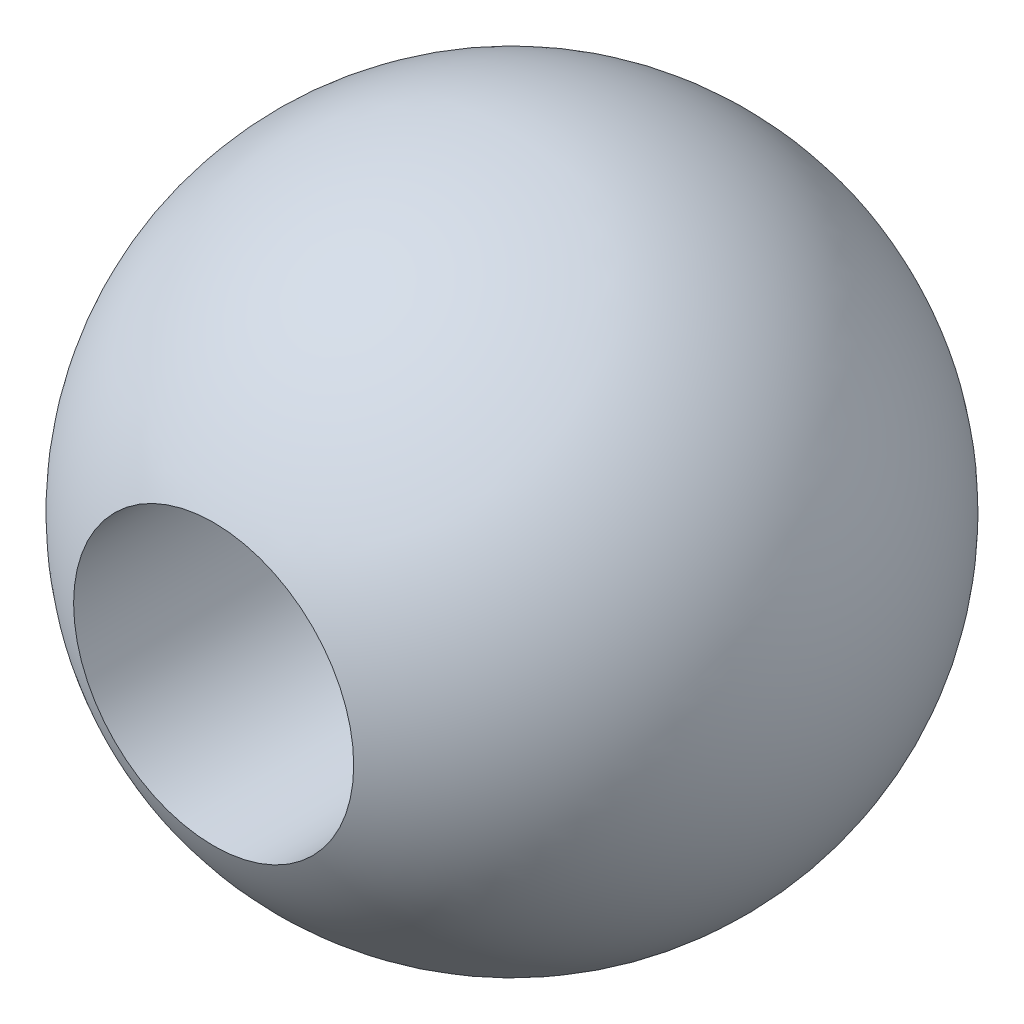
ISO-10303-21;
HEADER;
FILE_DESCRIPTION(('STEP AP214'),'2;1');
FILE_NAME('part.step','',(''),(''),'','','');
FILE_SCHEMA(('AUTOMOTIVE_DESIGN { 1 0 10303 214 1 1 1 1 }'));
ENDSEC;
DATA;
#1=APPLICATION_CONTEXT('core data for automotive mechanical design processes');
#2=APPLICATION_PROTOCOL_DEFINITION('international standard','automotive_design',2000,#1);
#3=PRODUCT_CONTEXT('',#1,'mechanical');
#4=PRODUCT('Part','Part','',(#3));
#5=PRODUCT_RELATED_PRODUCT_CATEGORY('part','',(#4));
#6=PRODUCT_DEFINITION_FORMATION('','',#4);
#7=PRODUCT_DEFINITION_CONTEXT('part definition',#1,'design');
#8=PRODUCT_DEFINITION('design','',#6,#7);
#9=PRODUCT_DEFINITION_SHAPE('','',#8);
#10=(LENGTH_UNIT() NAMED_UNIT(*) SI_UNIT(.MILLI.,.METRE.));
#11=(NAMED_UNIT(*) PLANE_ANGLE_UNIT() SI_UNIT($,.RADIAN.));
#12=(NAMED_UNIT(*) SI_UNIT($,.STERADIAN.) SOLID_ANGLE_UNIT());
#13=UNCERTAINTY_MEASURE_WITH_UNIT(LENGTH_MEASURE(1.E-05),#10,'distance_accuracy_value','');
#14=(GEOMETRIC_REPRESENTATION_CONTEXT(3) GLOBAL_UNCERTAINTY_ASSIGNED_CONTEXT((#13)) GLOBAL_UNIT_ASSIGNED_CONTEXT((#10,
#11,#12)) REPRESENTATION_CONTEXT('',''));
#15=CARTESIAN_POINT('',(0.,0.,0.));
#16=DIRECTION('',(0.,0.,1.));
#17=DIRECTION('',(1.,0.,0.));
#18=AXIS2_PLACEMENT_3D('',#15,#16,#17);
#19=CARTESIAN_POINT('',(-32.5193447894684,0.,0.));
#20=DIRECTION('',(-1.,0.,0.));
#21=DIRECTION('',(0.,0.,-1.));
#22=AXIS2_PLACEMENT_3D('',#19,#20,#21);
#23=SPHERICAL_SURFACE('',#22,2.);
#24=CARTESIAN_POINT('',(-32.5193447894684,0.,0.));
#25=DIRECTION('',(0.,0.,-1.));
#26=DIRECTION('',(-1.,0.,0.));
#27=AXIS2_PLACEMENT_3D('',#24,#25,#26);
#28=SPHERICAL_SURFACE('',#27,2.);
#29=CARTESIAN_POINT('',(-32.5193447894684,0.,1.81038669902317));
#30=DIRECTION('',(0.,0.,-1.));
#31=DIRECTION('',(-1.,0.,0.));
#32=AXIS2_PLACEMENT_3D('',#29,#30,#31);
#33=CIRCLE('',#32,0.849999999999999);
#34=CARTESIAN_POINT('',(-33.3693447894684,0.,1.81038669902317));
#35=VERTEX_POINT('',#34);
#36=EDGE_CURVE('E10',#35,#35,#33,.T.);
#37=ORIENTED_EDGE('',*,*,#36,.T.);
#38=EDGE_LOOP('',(#37));
#39=FACE_BOUND('',#38,.T.);
#40=CARTESIAN_POINT('',(-32.5193447894684,0.,-1.81038669902317));
#41=DIRECTION('',(0.,0.,1.));
#42=DIRECTION('',(1.,0.,0.));
#43=AXIS2_PLACEMENT_3D('',#40,#41,#42);
#44=CIRCLE('',#43,0.849999999999999);
#45=CARTESIAN_POINT('',(-31.6693447894684,0.,-1.81038669902317));
#46=VERTEX_POINT('',#45);
#47=EDGE_CURVE('E41',#46,#46,#44,.T.);
#48=ORIENTED_EDGE('',*,*,#47,.T.);
#49=EDGE_LOOP('',(#48));
#50=FACE_BOUND('',#49,.T.);
#51=ADVANCED_FACE('F35',(#39,#50),#28,.T.);
#52=CARTESIAN_POINT('',(-32.5193447894684,0.,-2.));
#53=DIRECTION('',(0.,0.,1.));
#54=DIRECTION('',(1.,0.,0.));
#55=AXIS2_PLACEMENT_3D('',#52,#53,#54);
#56=CYLINDRICAL_SURFACE('',#55,0.849999999999999);
#57=ORIENTED_EDGE('',*,*,#47,.F.);
#58=EDGE_LOOP('',(#57));
#59=FACE_BOUND('',#58,.T.);
#60=ORIENTED_EDGE('',*,*,#36,.F.);
#61=EDGE_LOOP('',(#60));
#62=FACE_BOUND('',#61,.T.);
#63=ADVANCED_FACE('F48',(#59,#62),#56,.F.);
#64=CLOSED_SHELL('',(#51,#63));
#65=MANIFOLD_SOLID_BREP('B2',#64);
#66=ADVANCED_BREP_SHAPE_REPRESENTATION('',(#18,#65),#14);
#67=SHAPE_DEFINITION_REPRESENTATION(#9,#66);
ENDSEC;
END-ISO-10303-21;
